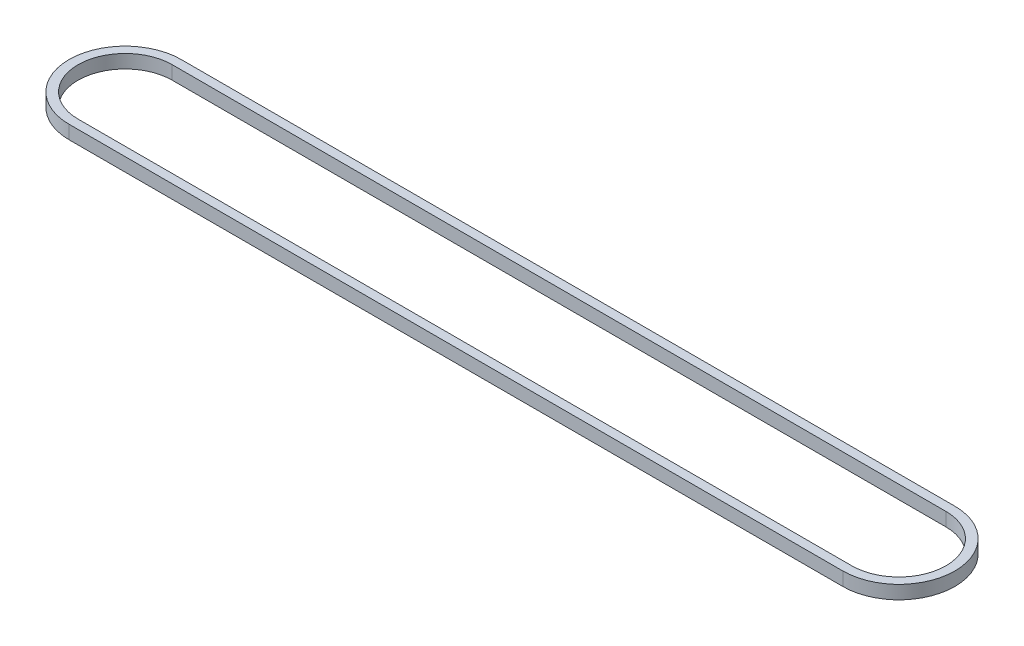
ISO-10303-21;
HEADER;
FILE_DESCRIPTION(('STEP AP214'),'2;1');
FILE_NAME('part.step','',(''),(''),'','','');
FILE_SCHEMA(('AUTOMOTIVE_DESIGN { 1 0 10303 214 1 1 1 1 }'));
ENDSEC;
DATA;
#1=APPLICATION_CONTEXT('core data for automotive mechanical design processes');
#2=APPLICATION_PROTOCOL_DEFINITION('international standard','automotive_design',2000,#1);
#3=PRODUCT_CONTEXT('',#1,'mechanical');
#4=PRODUCT('Part','Part','',(#3));
#5=PRODUCT_RELATED_PRODUCT_CATEGORY('part','',(#4));
#6=PRODUCT_DEFINITION_FORMATION('','',#4);
#7=PRODUCT_DEFINITION_CONTEXT('part definition',#1,'design');
#8=PRODUCT_DEFINITION('design','',#6,#7);
#9=PRODUCT_DEFINITION_SHAPE('','',#8);
#10=(LENGTH_UNIT() NAMED_UNIT(*) SI_UNIT(.MILLI.,.METRE.));
#11=(NAMED_UNIT(*) PLANE_ANGLE_UNIT() SI_UNIT($,.RADIAN.));
#12=(NAMED_UNIT(*) SI_UNIT($,.STERADIAN.) SOLID_ANGLE_UNIT());
#13=UNCERTAINTY_MEASURE_WITH_UNIT(LENGTH_MEASURE(1.E-05),#10,'distance_accuracy_value','');
#14=(GEOMETRIC_REPRESENTATION_CONTEXT(3) GLOBAL_UNCERTAINTY_ASSIGNED_CONTEXT((#13)) GLOBAL_UNIT_ASSIGNED_CONTEXT((#10,
#11,#12)) REPRESENTATION_CONTEXT('',''));
#15=CARTESIAN_POINT('',(0.,0.,0.));
#16=DIRECTION('',(0.,0.,1.));
#17=DIRECTION('',(1.,0.,0.));
#18=AXIS2_PLACEMENT_3D('',#15,#16,#17);
#19=CARTESIAN_POINT('',(-32.6689284068016,3.,0.));
#20=DIRECTION('',(0.,1.,0.));
#21=DIRECTION('',(0.,0.,1.));
#22=AXIS2_PLACEMENT_3D('',#19,#20,#21);
#23=PLANE('',#22);
#24=CARTESIAN_POINT('',(-32.6689284068016,3.,0.));
#25=DIRECTION('',(0.,1.,0.));
#26=DIRECTION('',(0.,0.,1.));
#27=AXIS2_PLACEMENT_3D('',#24,#25,#26);
#28=CIRCLE('',#27,12.5);
#29=CARTESIAN_POINT('',(-32.6689284068016,3.,-12.5));
#30=VERTEX_POINT('',#29);
#31=CARTESIAN_POINT('',(-32.6689284068016,3.,12.5));
#32=VERTEX_POINT('',#31);
#33=EDGE_CURVE('E134',#30,#32,#28,.T.);
#34=ORIENTED_EDGE('',*,*,#33,.T.);
#35=DIRECTION('',(1.,0.,0.));
#36=VECTOR('',#35,1.);
#37=CARTESIAN_POINT('',(-32.6689284068016,3.,12.5));
#38=LINE('',#37,#36);
#39=CARTESIAN_POINT('',(139.831071593198,3.,12.5));
#40=VERTEX_POINT('',#39);
#41=EDGE_CURVE('E137',#32,#40,#38,.T.);
#42=ORIENTED_EDGE('',*,*,#41,.T.);
#43=CARTESIAN_POINT('',(139.831071593198,3.,0.));
#44=DIRECTION('',(0.,1.,0.));
#45=DIRECTION('',(0.,0.,1.));
#46=AXIS2_PLACEMENT_3D('',#43,#44,#45);
#47=CIRCLE('',#46,12.5);
#48=CARTESIAN_POINT('',(139.831071593198,3.,-12.5));
#49=VERTEX_POINT('',#48);
#50=EDGE_CURVE('E140',#40,#49,#47,.T.);
#51=ORIENTED_EDGE('',*,*,#50,.T.);
#52=DIRECTION('',(-1.,0.,0.));
#53=VECTOR('',#52,1.);
#54=CARTESIAN_POINT('',(-32.6689284068016,3.,-12.5));
#55=LINE('',#54,#53);
#56=EDGE_CURVE('E142',#49,#30,#55,.T.);
#57=ORIENTED_EDGE('',*,*,#56,.T.);
#58=EDGE_LOOP('',(#34,#42,#51,#57));
#59=FACE_BOUND('',#58,.T.);
#60=DIRECTION('',(1.,0.,0.));
#61=VECTOR('',#60,1.);
#62=CARTESIAN_POINT('',(-32.6689284068016,3.,10.5));
#63=LINE('',#62,#61);
#64=CARTESIAN_POINT('',(-32.6689284068016,3.,10.5));
#65=VERTEX_POINT('',#64);
#66=CARTESIAN_POINT('',(139.831071593198,3.,10.5));
#67=VERTEX_POINT('',#66);
#68=EDGE_CURVE('E106',#65,#67,#63,.T.);
#69=ORIENTED_EDGE('',*,*,#68,.F.);
#70=CARTESIAN_POINT('',(-32.6689284068016,3.,0.));
#71=DIRECTION('',(0.,1.,0.));
#72=DIRECTION('',(0.,0.,1.));
#73=AXIS2_PLACEMENT_3D('',#70,#71,#72);
#74=CIRCLE('',#73,10.5);
#75=CARTESIAN_POINT('',(-32.6689284068016,3.,-10.5));
#76=VERTEX_POINT('',#75);
#77=EDGE_CURVE('E98',#76,#65,#74,.T.);
#78=ORIENTED_EDGE('',*,*,#77,.F.);
#79=DIRECTION('',(-1.,0.,0.));
#80=VECTOR('',#79,1.);
#81=CARTESIAN_POINT('',(-32.6689284068016,3.,-10.5));
#82=LINE('',#81,#80);
#83=CARTESIAN_POINT('',(139.831071593198,3.,-10.5));
#84=VERTEX_POINT('',#83);
#85=EDGE_CURVE('E120',#84,#76,#82,.T.);
#86=ORIENTED_EDGE('',*,*,#85,.F.);
#87=CARTESIAN_POINT('',(139.831071593198,3.,0.));
#88=DIRECTION('',(0.,1.,0.));
#89=DIRECTION('',(0.,0.,1.));
#90=AXIS2_PLACEMENT_3D('',#87,#88,#89);
#91=CIRCLE('',#90,10.5);
#92=EDGE_CURVE('E118',#67,#84,#91,.T.);
#93=ORIENTED_EDGE('',*,*,#92,.F.);
#94=EDGE_LOOP('',(#69,#78,#86,#93));
#95=FACE_BOUND('',#94,.T.);
#96=ADVANCED_FACE('F33',(#59,#95),#23,.T.);
#97=CARTESIAN_POINT('',(-32.6689284068016,0.,0.));
#98=DIRECTION('',(0.,1.,0.));
#99=DIRECTION('',(0.,0.,1.));
#100=AXIS2_PLACEMENT_3D('',#97,#98,#99);
#101=PLANE('',#100);
#102=CARTESIAN_POINT('',(-32.6689284068016,0.,0.));
#103=DIRECTION('',(0.,1.,0.));
#104=DIRECTION('',(0.,0.,1.));
#105=AXIS2_PLACEMENT_3D('',#102,#103,#104);
#106=CIRCLE('',#105,12.5);
#107=CARTESIAN_POINT('',(-32.6689284068016,0.,-12.5));
#108=VERTEX_POINT('',#107);
#109=CARTESIAN_POINT('',(-32.6689284068016,0.,12.5));
#110=VERTEX_POINT('',#109);
#111=EDGE_CURVE('E114',#108,#110,#106,.T.);
#112=ORIENTED_EDGE('',*,*,#111,.F.);
#113=DIRECTION('',(-1.,0.,0.));
#114=VECTOR('',#113,1.);
#115=CARTESIAN_POINT('',(-32.6689284068016,0.,-12.5));
#116=LINE('',#115,#114);
#117=CARTESIAN_POINT('',(139.831071593198,0.,-12.5));
#118=VERTEX_POINT('',#117);
#119=EDGE_CURVE('E138',#118,#108,#116,.T.);
#120=ORIENTED_EDGE('',*,*,#119,.F.);
#121=CARTESIAN_POINT('',(139.831071593198,0.,0.));
#122=DIRECTION('',(0.,1.,0.));
#123=DIRECTION('',(0.,0.,1.));
#124=AXIS2_PLACEMENT_3D('',#121,#122,#123);
#125=CIRCLE('',#124,12.5);
#126=CARTESIAN_POINT('',(139.831071593198,0.,12.5));
#127=VERTEX_POINT('',#126);
#128=EDGE_CURVE('E149',#127,#118,#125,.T.);
#129=ORIENTED_EDGE('',*,*,#128,.F.);
#130=DIRECTION('',(1.,0.,0.));
#131=VECTOR('',#130,1.);
#132=CARTESIAN_POINT('',(-32.6689284068016,0.,12.5));
#133=LINE('',#132,#131);
#134=EDGE_CURVE('E147',#110,#127,#133,.T.);
#135=ORIENTED_EDGE('',*,*,#134,.F.);
#136=EDGE_LOOP('',(#112,#120,#129,#135));
#137=FACE_BOUND('',#136,.T.);
#138=CARTESIAN_POINT('',(-32.6689284068016,0.,0.));
#139=DIRECTION('',(0.,1.,0.));
#140=DIRECTION('',(0.,0.,1.));
#141=AXIS2_PLACEMENT_3D('',#138,#139,#140);
#142=CIRCLE('',#141,10.5);
#143=CARTESIAN_POINT('',(-32.6689284068016,0.,-10.5));
#144=VERTEX_POINT('',#143);
#145=CARTESIAN_POINT('',(-32.6689284068016,0.,10.5));
#146=VERTEX_POINT('',#145);
#147=EDGE_CURVE('E56',#144,#146,#142,.T.);
#148=ORIENTED_EDGE('',*,*,#147,.T.);
#149=DIRECTION('',(1.,0.,0.));
#150=VECTOR('',#149,1.);
#151=CARTESIAN_POINT('',(-32.6689284068016,0.,10.5));
#152=LINE('',#151,#150);
#153=CARTESIAN_POINT('',(139.831071593198,0.,10.5));
#154=VERTEX_POINT('',#153);
#155=EDGE_CURVE('E113',#146,#154,#152,.T.);
#156=ORIENTED_EDGE('',*,*,#155,.T.);
#157=CARTESIAN_POINT('',(139.831071593198,0.,0.));
#158=DIRECTION('',(0.,1.,0.));
#159=DIRECTION('',(0.,0.,1.));
#160=AXIS2_PLACEMENT_3D('',#157,#158,#159);
#161=CIRCLE('',#160,10.5);
#162=CARTESIAN_POINT('',(139.831071593198,0.,-10.5));
#163=VERTEX_POINT('',#162);
#164=EDGE_CURVE('E126',#154,#163,#161,.T.);
#165=ORIENTED_EDGE('',*,*,#164,.T.);
#166=DIRECTION('',(-1.,0.,0.));
#167=VECTOR('',#166,1.);
#168=CARTESIAN_POINT('',(-32.6689284068016,0.,-10.5));
#169=LINE('',#168,#167);
#170=EDGE_CURVE('E107',#163,#144,#169,.T.);
#171=ORIENTED_EDGE('',*,*,#170,.T.);
#172=EDGE_LOOP('',(#148,#156,#165,#171));
#173=FACE_BOUND('',#172,.T.);
#174=ADVANCED_FACE('F167',(#137,#173),#101,.F.);
#175=CARTESIAN_POINT('',(-32.6689284068016,3.,0.));
#176=DIRECTION('',(0.,-1.,0.));
#177=DIRECTION('',(0.,0.,-1.));
#178=AXIS2_PLACEMENT_3D('',#175,#176,#177);
#179=CYLINDRICAL_SURFACE('',#178,12.5);
#180=ORIENTED_EDGE('',*,*,#111,.T.);
#181=DIRECTION('',(0.,-1.,0.));
#182=VECTOR('',#181,1.);
#183=CARTESIAN_POINT('',(-32.6689284068016,3.,12.5));
#184=LINE('',#183,#182);
#185=EDGE_CURVE('E11',#32,#110,#184,.T.);
#186=ORIENTED_EDGE('',*,*,#185,.F.);
#187=ORIENTED_EDGE('',*,*,#33,.F.);
#188=DIRECTION('',(0.,-1.,0.));
#189=VECTOR('',#188,1.);
#190=CARTESIAN_POINT('',(-32.6689284068016,3.,-12.5));
#191=LINE('',#190,#189);
#192=EDGE_CURVE('E144',#30,#108,#191,.T.);
#193=ORIENTED_EDGE('',*,*,#192,.T.);
#194=EDGE_LOOP('',(#180,#186,#187,#193));
#195=FACE_BOUND('',#194,.T.);
#196=ADVANCED_FACE('F35',(#195),#179,.T.);
#197=CARTESIAN_POINT('',(-32.6689284068016,3.,12.5));
#198=DIRECTION('',(0.,0.,-1.));
#199=DIRECTION('',(-1.,0.,0.));
#200=AXIS2_PLACEMENT_3D('',#197,#198,#199);
#201=PLANE('',#200);
#202=ORIENTED_EDGE('',*,*,#134,.T.);
#203=DIRECTION('',(0.,-1.,0.));
#204=VECTOR('',#203,1.);
#205=CARTESIAN_POINT('',(139.831071593198,3.,12.5));
#206=LINE('',#205,#204);
#207=EDGE_CURVE('E41',#40,#127,#206,.T.);
#208=ORIENTED_EDGE('',*,*,#207,.F.);
#209=ORIENTED_EDGE('',*,*,#41,.F.);
#210=ORIENTED_EDGE('',*,*,#185,.T.);
#211=EDGE_LOOP('',(#202,#208,#209,#210));
#212=FACE_BOUND('',#211,.T.);
#213=ADVANCED_FACE('F177',(#212),#201,.F.);
#214=CARTESIAN_POINT('',(139.831071593198,3.,0.));
#215=DIRECTION('',(0.,-1.,0.));
#216=DIRECTION('',(0.,0.,-1.));
#217=AXIS2_PLACEMENT_3D('',#214,#215,#216);
#218=CYLINDRICAL_SURFACE('',#217,12.5);
#219=ORIENTED_EDGE('',*,*,#128,.T.);
#220=DIRECTION('',(0.,-1.,0.));
#221=VECTOR('',#220,1.);
#222=CARTESIAN_POINT('',(139.831071593198,3.,-12.5));
#223=LINE('',#222,#221);
#224=EDGE_CURVE('E154',#49,#118,#223,.T.);
#225=ORIENTED_EDGE('',*,*,#224,.F.);
#226=ORIENTED_EDGE('',*,*,#50,.F.);
#227=ORIENTED_EDGE('',*,*,#207,.T.);
#228=EDGE_LOOP('',(#219,#225,#226,#227));
#229=FACE_BOUND('',#228,.T.);
#230=ADVANCED_FACE('F161',(#229),#218,.T.);
#231=CARTESIAN_POINT('',(-32.6689284068016,3.,-12.5));
#232=DIRECTION('',(0.,0.,1.));
#233=DIRECTION('',(1.,0.,0.));
#234=AXIS2_PLACEMENT_3D('',#231,#232,#233);
#235=PLANE('',#234);
#236=ORIENTED_EDGE('',*,*,#119,.T.);
#237=ORIENTED_EDGE('',*,*,#192,.F.);
#238=ORIENTED_EDGE('',*,*,#56,.F.);
#239=ORIENTED_EDGE('',*,*,#224,.T.);
#240=EDGE_LOOP('',(#236,#237,#238,#239));
#241=FACE_BOUND('',#240,.T.);
#242=ADVANCED_FACE('F171',(#241),#235,.F.);
#243=CARTESIAN_POINT('',(-32.6689284068016,3.,0.));
#244=DIRECTION('',(0.,-1.,0.));
#245=DIRECTION('',(0.,0.,-1.));
#246=AXIS2_PLACEMENT_3D('',#243,#244,#245);
#247=CYLINDRICAL_SURFACE('',#246,10.5);
#248=ORIENTED_EDGE('',*,*,#147,.F.);
#249=DIRECTION('',(0.,-1.,0.));
#250=VECTOR('',#249,1.);
#251=CARTESIAN_POINT('',(-32.6689284068016,3.,-10.5));
#252=LINE('',#251,#250);
#253=EDGE_CURVE('E102',#76,#144,#252,.T.);
#254=ORIENTED_EDGE('',*,*,#253,.F.);
#255=ORIENTED_EDGE('',*,*,#77,.T.);
#256=DIRECTION('',(0.,-1.,0.));
#257=VECTOR('',#256,1.);
#258=CARTESIAN_POINT('',(-32.6689284068016,3.,10.5));
#259=LINE('',#258,#257);
#260=EDGE_CURVE('E101',#65,#146,#259,.T.);
#261=ORIENTED_EDGE('',*,*,#260,.T.);
#262=EDGE_LOOP('',(#248,#254,#255,#261));
#263=FACE_BOUND('',#262,.T.);
#264=ADVANCED_FACE('F100',(#263),#247,.F.);
#265=CARTESIAN_POINT('',(-32.6689284068016,3.,10.5));
#266=DIRECTION('',(0.,0.,-1.));
#267=DIRECTION('',(-1.,0.,0.));
#268=AXIS2_PLACEMENT_3D('',#265,#266,#267);
#269=PLANE('',#268);
#270=ORIENTED_EDGE('',*,*,#155,.F.);
#271=ORIENTED_EDGE('',*,*,#260,.F.);
#272=ORIENTED_EDGE('',*,*,#68,.T.);
#273=DIRECTION('',(0.,-1.,0.));
#274=VECTOR('',#273,1.);
#275=CARTESIAN_POINT('',(139.831071593198,3.,10.5));
#276=LINE('',#275,#274);
#277=EDGE_CURVE('E115',#67,#154,#276,.T.);
#278=ORIENTED_EDGE('',*,*,#277,.T.);
#279=EDGE_LOOP('',(#270,#271,#272,#278));
#280=FACE_BOUND('',#279,.T.);
#281=ADVANCED_FACE('F110',(#280),#269,.T.);
#282=CARTESIAN_POINT('',(139.831071593198,3.,0.));
#283=DIRECTION('',(0.,-1.,0.));
#284=DIRECTION('',(0.,0.,-1.));
#285=AXIS2_PLACEMENT_3D('',#282,#283,#284);
#286=CYLINDRICAL_SURFACE('',#285,10.5);
#287=ORIENTED_EDGE('',*,*,#164,.F.);
#288=ORIENTED_EDGE('',*,*,#277,.F.);
#289=ORIENTED_EDGE('',*,*,#92,.T.);
#290=DIRECTION('',(0.,-1.,0.));
#291=VECTOR('',#290,1.);
#292=CARTESIAN_POINT('',(139.831071593198,3.,-10.5));
#293=LINE('',#292,#291);
#294=EDGE_CURVE('E48',#84,#163,#293,.T.);
#295=ORIENTED_EDGE('',*,*,#294,.T.);
#296=EDGE_LOOP('',(#287,#288,#289,#295));
#297=FACE_BOUND('',#296,.T.);
#298=ADVANCED_FACE('F200',(#297),#286,.F.);
#299=CARTESIAN_POINT('',(-32.6689284068016,3.,-10.5));
#300=DIRECTION('',(0.,0.,1.));
#301=DIRECTION('',(1.,0.,0.));
#302=AXIS2_PLACEMENT_3D('',#299,#300,#301);
#303=PLANE('',#302);
#304=ORIENTED_EDGE('',*,*,#170,.F.);
#305=ORIENTED_EDGE('',*,*,#294,.F.);
#306=ORIENTED_EDGE('',*,*,#85,.T.);
#307=ORIENTED_EDGE('',*,*,#253,.T.);
#308=EDGE_LOOP('',(#304,#305,#306,#307));
#309=FACE_BOUND('',#308,.T.);
#310=ADVANCED_FACE('F204',(#309),#303,.T.);
#311=CLOSED_SHELL('',(#96,#174,#196,#213,#230,#242,#264,#281,#298,#310));
#312=MANIFOLD_SOLID_BREP('B2',#311);
#313=ADVANCED_BREP_SHAPE_REPRESENTATION('',(#18,#312),#14);
#314=SHAPE_DEFINITION_REPRESENTATION(#9,#313);
ENDSEC;
END-ISO-10303-21;
